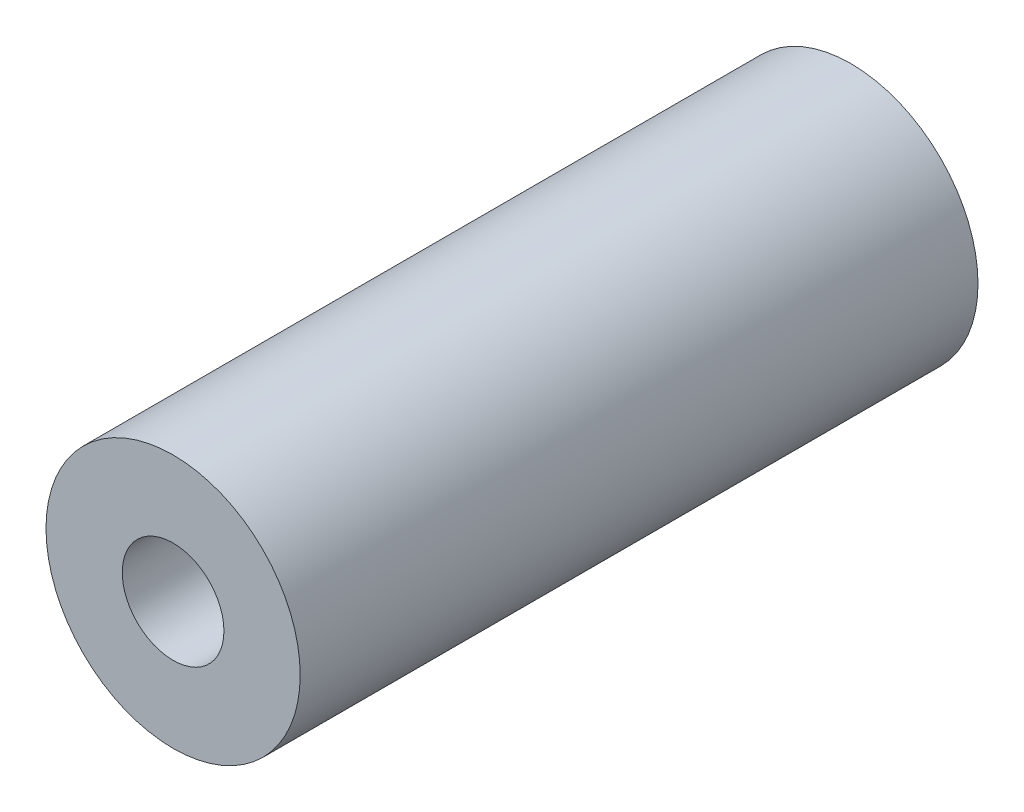
ISO-10303-21;
HEADER;
FILE_DESCRIPTION(('STEP AP214'),'2;1');
FILE_NAME('part.step','',(''),(''),'','','');
FILE_SCHEMA(('AUTOMOTIVE_DESIGN { 1 0 10303 214 1 1 1 1 }'));
ENDSEC;
DATA;
#1=APPLICATION_CONTEXT('core data for automotive mechanical design processes');
#2=APPLICATION_PROTOCOL_DEFINITION('international standard','automotive_design',2000,#1);
#3=PRODUCT_CONTEXT('',#1,'mechanical');
#4=PRODUCT('Part','Part','',(#3));
#5=PRODUCT_RELATED_PRODUCT_CATEGORY('part','',(#4));
#6=PRODUCT_DEFINITION_FORMATION('','',#4);
#7=PRODUCT_DEFINITION_CONTEXT('part definition',#1,'design');
#8=PRODUCT_DEFINITION('design','',#6,#7);
#9=PRODUCT_DEFINITION_SHAPE('','',#8);
#10=(LENGTH_UNIT() NAMED_UNIT(*) SI_UNIT(.MILLI.,.METRE.));
#11=(NAMED_UNIT(*) PLANE_ANGLE_UNIT() SI_UNIT($,.RADIAN.));
#12=(NAMED_UNIT(*) SI_UNIT($,.STERADIAN.) SOLID_ANGLE_UNIT());
#13=UNCERTAINTY_MEASURE_WITH_UNIT(LENGTH_MEASURE(1.E-05),#10,'distance_accuracy_value','');
#14=(GEOMETRIC_REPRESENTATION_CONTEXT(3) GLOBAL_UNCERTAINTY_ASSIGNED_CONTEXT((#13)) GLOBAL_UNIT_ASSIGNED_CONTEXT((#10,
#11,#12)) REPRESENTATION_CONTEXT('',''));
#15=CARTESIAN_POINT('',(0.,0.,0.));
#16=DIRECTION('',(0.,0.,1.));
#17=DIRECTION('',(1.,0.,0.));
#18=AXIS2_PLACEMENT_3D('',#15,#16,#17);
#19=CARTESIAN_POINT('',(0.,0.,40.));
#20=DIRECTION('',(0.,0.,1.));
#21=DIRECTION('',(1.,0.,0.));
#22=AXIS2_PLACEMENT_3D('',#19,#20,#21);
#23=PLANE('',#22);
#24=CARTESIAN_POINT('',(0.,0.,40.));
#25=DIRECTION('',(0.,0.,1.));
#26=DIRECTION('',(1.,0.,0.));
#27=AXIS2_PLACEMENT_3D('',#24,#25,#26);
#28=CIRCLE('',#27,7.5);
#29=CARTESIAN_POINT('',(7.5,0.,40.));
#30=VERTEX_POINT('',#29);
#31=EDGE_CURVE('E10',#30,#30,#28,.T.);
#32=ORIENTED_EDGE('',*,*,#31,.T.);
#33=EDGE_LOOP('',(#32));
#34=FACE_BOUND('',#33,.T.);
#35=CARTESIAN_POINT('',(0.,0.,40.));
#36=DIRECTION('',(0.,0.,1.));
#37=DIRECTION('',(1.,0.,0.));
#38=AXIS2_PLACEMENT_3D('',#35,#36,#37);
#39=CIRCLE('',#38,3.);
#40=CARTESIAN_POINT('',(3.,0.,40.));
#41=VERTEX_POINT('',#40);
#42=EDGE_CURVE('E42',#41,#41,#39,.T.);
#43=ORIENTED_EDGE('',*,*,#42,.F.);
#44=EDGE_LOOP('',(#43));
#45=FACE_BOUND('',#44,.T.);
#46=ADVANCED_FACE('F31',(#34,#45),#23,.T.);
#47=CARTESIAN_POINT('',(0.,0.,0.));
#48=DIRECTION('',(0.,0.,1.));
#49=DIRECTION('',(1.,0.,0.));
#50=AXIS2_PLACEMENT_3D('',#47,#48,#49);
#51=PLANE('',#50);
#52=CARTESIAN_POINT('',(0.,0.,0.));
#53=DIRECTION('',(0.,0.,1.));
#54=DIRECTION('',(1.,0.,0.));
#55=AXIS2_PLACEMENT_3D('',#52,#53,#54);
#56=CIRCLE('',#55,7.5);
#57=CARTESIAN_POINT('',(7.5,0.,0.));
#58=VERTEX_POINT('',#57);
#59=EDGE_CURVE('E35',#58,#58,#56,.T.);
#60=ORIENTED_EDGE('',*,*,#59,.F.);
#61=EDGE_LOOP('',(#60));
#62=FACE_BOUND('',#61,.T.);
#63=CARTESIAN_POINT('',(0.,0.,0.));
#64=DIRECTION('',(0.,0.,1.));
#65=DIRECTION('',(1.,0.,0.));
#66=AXIS2_PLACEMENT_3D('',#63,#64,#65);
#67=CIRCLE('',#66,3.);
#68=CARTESIAN_POINT('',(3.,0.,0.));
#69=VERTEX_POINT('',#68);
#70=EDGE_CURVE('E44',#69,#69,#67,.T.);
#71=ORIENTED_EDGE('',*,*,#70,.T.);
#72=EDGE_LOOP('',(#71));
#73=FACE_BOUND('',#72,.T.);
#74=ADVANCED_FACE('F54',(#62,#73),#51,.F.);
#75=CARTESIAN_POINT('',(0.,0.,40.));
#76=DIRECTION('',(0.,0.,-1.));
#77=DIRECTION('',(-1.,0.,0.));
#78=AXIS2_PLACEMENT_3D('',#75,#76,#77);
#79=CYLINDRICAL_SURFACE('',#78,7.5);
#80=ORIENTED_EDGE('',*,*,#31,.F.);
#81=EDGE_LOOP('',(#80));
#82=FACE_BOUND('',#81,.T.);
#83=ORIENTED_EDGE('',*,*,#59,.T.);
#84=EDGE_LOOP('',(#83));
#85=FACE_BOUND('',#84,.T.);
#86=ADVANCED_FACE('F33',(#82,#85),#79,.T.);
#87=CARTESIAN_POINT('',(0.,0.,40.));
#88=DIRECTION('',(0.,0.,-1.));
#89=DIRECTION('',(-1.,0.,0.));
#90=AXIS2_PLACEMENT_3D('',#87,#88,#89);
#91=CYLINDRICAL_SURFACE('',#90,3.);
#92=ORIENTED_EDGE('',*,*,#42,.T.);
#93=EDGE_LOOP('',(#92));
#94=FACE_BOUND('',#93,.T.);
#95=ORIENTED_EDGE('',*,*,#70,.F.);
#96=EDGE_LOOP('',(#95));
#97=FACE_BOUND('',#96,.T.);
#98=ADVANCED_FACE('F50',(#94,#97),#91,.F.);
#99=CLOSED_SHELL('',(#46,#74,#86,#98));
#100=MANIFOLD_SOLID_BREP('B2',#99);
#101=ADVANCED_BREP_SHAPE_REPRESENTATION('',(#18,#100),#14);
#102=SHAPE_DEFINITION_REPRESENTATION(#9,#101);
ENDSEC;
END-ISO-10303-21;
